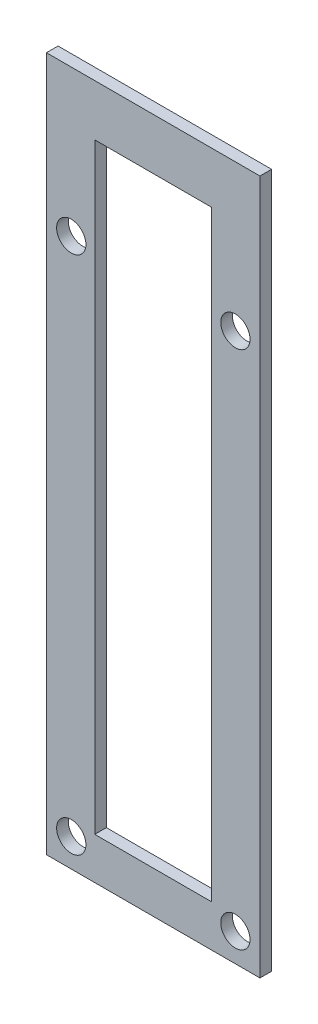
ISO-10303-21;
HEADER;
FILE_DESCRIPTION(('STEP AP214'),'2;1');
FILE_NAME('part.step','',(''),(''),'','','');
FILE_SCHEMA(('AUTOMOTIVE_DESIGN { 1 0 10303 214 1 1 1 1 }'));
ENDSEC;
DATA;
#1=APPLICATION_CONTEXT('core data for automotive mechanical design processes');
#2=APPLICATION_PROTOCOL_DEFINITION('international standard','automotive_design',2000,#1);
#3=PRODUCT_CONTEXT('',#1,'mechanical');
#4=PRODUCT('Part','Part','',(#3));
#5=PRODUCT_RELATED_PRODUCT_CATEGORY('part','',(#4));
#6=PRODUCT_DEFINITION_FORMATION('','',#4);
#7=PRODUCT_DEFINITION_CONTEXT('part definition',#1,'design');
#8=PRODUCT_DEFINITION('design','',#6,#7);
#9=PRODUCT_DEFINITION_SHAPE('','',#8);
#10=(LENGTH_UNIT() NAMED_UNIT(*) SI_UNIT(.MILLI.,.METRE.));
#11=(NAMED_UNIT(*) PLANE_ANGLE_UNIT() SI_UNIT($,.RADIAN.));
#12=(NAMED_UNIT(*) SI_UNIT($,.STERADIAN.) SOLID_ANGLE_UNIT());
#13=UNCERTAINTY_MEASURE_WITH_UNIT(LENGTH_MEASURE(1.E-05),#10,'distance_accuracy_value','');
#14=(GEOMETRIC_REPRESENTATION_CONTEXT(3) GLOBAL_UNCERTAINTY_ASSIGNED_CONTEXT((#13)) GLOBAL_UNIT_ASSIGNED_CONTEXT((#10,
#11,#12)) REPRESENTATION_CONTEXT('',''));
#15=CARTESIAN_POINT('',(0.,0.,0.));
#16=DIRECTION('',(0.,0.,1.));
#17=DIRECTION('',(1.,0.,0.));
#18=AXIS2_PLACEMENT_3D('',#15,#16,#17);
#19=CARTESIAN_POINT('',(-6.6,94.86,1.5875));
#20=DIRECTION('',(1.,0.,0.));
#21=DIRECTION('',(0.,1.,0.));
#22=AXIS2_PLACEMENT_3D('',#19,#20,#21);
#23=PLANE('',#22);
#24=DIRECTION('',(0.,0.,-1.));
#25=VECTOR('',#24,1.);
#26=CARTESIAN_POINT('',(-6.59999999999172,87.8560754392765,1.5875));
#27=LINE('',#26,#25);
#28=CARTESIAN_POINT('',(-6.6,87.8560754392765,1.5875));
#29=VERTEX_POINT('',#28);
#30=CARTESIAN_POINT('',(-6.59999999999172,87.8560754392765,0.));
#31=VERTEX_POINT('',#30);
#32=EDGE_CURVE('E112',#29,#31,#27,.T.);
#33=ORIENTED_EDGE('',*,*,#32,.T.);
#34=DIRECTION('',(0.,-1.,0.));
#35=VECTOR('',#34,1.);
#36=CARTESIAN_POINT('',(-6.6,94.86,0.));
#37=LINE('',#36,#35);
#38=CARTESIAN_POINT('',(-6.59999999999999,5.70999999999999,0.));
#39=VERTEX_POINT('',#38);
#40=EDGE_CURVE('E102',#31,#39,#37,.T.);
#41=ORIENTED_EDGE('',*,*,#40,.T.);
#42=DIRECTION('',(0.,0.,-1.));
#43=VECTOR('',#42,1.);
#44=CARTESIAN_POINT('',(-6.59999999999999,5.70999999999999,1.5875));
#45=LINE('',#44,#43);
#46=CARTESIAN_POINT('',(-6.59999999999999,5.70999999999999,1.5875));
#47=VERTEX_POINT('',#46);
#48=EDGE_CURVE('E159',#47,#39,#45,.T.);
#49=ORIENTED_EDGE('',*,*,#48,.F.);
#50=DIRECTION('',(0.,-1.,0.));
#51=VECTOR('',#50,1.);
#52=CARTESIAN_POINT('',(-6.6,94.86,1.5875));
#53=LINE('',#52,#51);
#54=EDGE_CURVE('E58',#29,#47,#53,.T.);
#55=ORIENTED_EDGE('',*,*,#54,.F.);
#56=EDGE_LOOP('',(#33,#41,#49,#55));
#57=FACE_BOUND('',#56,.T.);
#58=ADVANCED_FACE('F33',(#57),#23,.F.);
#59=CARTESIAN_POINT('',(-22.56,5.70999999999999,1.5875));
#60=DIRECTION('',(-1.,0.,0.));
#61=DIRECTION('',(0.,0.,1.));
#62=AXIS2_PLACEMENT_3D('',#59,#60,#61);
#63=PLANE('',#62);
#64=DIRECTION('',(0.,0.,-1.));
#65=VECTOR('',#64,1.);
#66=CARTESIAN_POINT('',(-22.56,87.8560754392765,1.5875));
#67=LINE('',#66,#65);
#68=CARTESIAN_POINT('',(-22.56,87.8560754392765,1.5875));
#69=VERTEX_POINT('',#68);
#70=CARTESIAN_POINT('',(-22.56,87.8560754392765,0.));
#71=VERTEX_POINT('',#70);
#72=EDGE_CURVE('E50',#69,#71,#67,.T.);
#73=ORIENTED_EDGE('',*,*,#72,.F.);
#74=DIRECTION('',(0.,1.,0.));
#75=VECTOR('',#74,1.);
#76=CARTESIAN_POINT('',(-22.56,5.70999999999999,1.5875));
#77=LINE('',#76,#75);
#78=CARTESIAN_POINT('',(-22.56,5.70999999999999,1.5875));
#79=VERTEX_POINT('',#78);
#80=EDGE_CURVE('E136',#79,#69,#77,.T.);
#81=ORIENTED_EDGE('',*,*,#80,.F.);
#82=DIRECTION('',(0.,0.,-1.));
#83=VECTOR('',#82,1.);
#84=CARTESIAN_POINT('',(-22.56,5.70999999999999,1.5875));
#85=LINE('',#84,#83);
#86=CARTESIAN_POINT('',(-22.56,5.70999999999999,0.));
#87=VERTEX_POINT('',#86);
#88=EDGE_CURVE('E156',#79,#87,#85,.T.);
#89=ORIENTED_EDGE('',*,*,#88,.T.);
#90=DIRECTION('',(0.,1.,0.));
#91=VECTOR('',#90,1.);
#92=CARTESIAN_POINT('',(-22.56,5.70999999999999,0.));
#93=LINE('',#92,#91);
#94=EDGE_CURVE('E146',#87,#71,#93,.T.);
#95=ORIENTED_EDGE('',*,*,#94,.T.);
#96=EDGE_LOOP('',(#73,#81,#89,#95));
#97=FACE_BOUND('',#96,.T.);
#98=ADVANCED_FACE('F221',(#97),#63,.F.);
#99=CARTESIAN_POINT('',(-29.16,0.,1.5875));
#100=DIRECTION('',(0.,1.,0.));
#101=DIRECTION('',(0.,0.,1.));
#102=AXIS2_PLACEMENT_3D('',#99,#100,#101);
#103=PLANE('',#102);
#104=DIRECTION('',(1.,0.,0.));
#105=VECTOR('',#104,1.);
#106=CARTESIAN_POINT('',(-29.16,0.,0.));
#107=LINE('',#106,#105);
#108=CARTESIAN_POINT('',(-29.16,0.,0.));
#109=VERTEX_POINT('',#108);
#110=CARTESIAN_POINT('',(0.,0.,0.));
#111=VERTEX_POINT('',#110);
#112=EDGE_CURVE('E121',#109,#111,#107,.T.);
#113=ORIENTED_EDGE('',*,*,#112,.T.);
#114=DIRECTION('',(0.,0.,-1.));
#115=VECTOR('',#114,1.);
#116=CARTESIAN_POINT('',(0.,0.,1.5875));
#117=LINE('',#116,#115);
#118=CARTESIAN_POINT('',(0.,0.,1.5875));
#119=VERTEX_POINT('',#118);
#120=EDGE_CURVE('E11',#119,#111,#117,.T.);
#121=ORIENTED_EDGE('',*,*,#120,.F.);
#122=DIRECTION('',(1.,0.,0.));
#123=VECTOR('',#122,1.);
#124=CARTESIAN_POINT('',(-29.16,0.,1.5875));
#125=LINE('',#124,#123);
#126=CARTESIAN_POINT('',(-29.16,0.,1.5875));
#127=VERTEX_POINT('',#126);
#128=EDGE_CURVE('E125',#127,#119,#125,.T.);
#129=ORIENTED_EDGE('',*,*,#128,.F.);
#130=DIRECTION('',(0.,0.,-1.));
#131=VECTOR('',#130,1.);
#132=CARTESIAN_POINT('',(-29.16,0.,1.5875));
#133=LINE('',#132,#131);
#134=EDGE_CURVE('E140',#127,#109,#133,.T.);
#135=ORIENTED_EDGE('',*,*,#134,.T.);
#136=EDGE_LOOP('',(#113,#121,#129,#135));
#137=FACE_BOUND('',#136,.T.);
#138=ADVANCED_FACE('F35',(#137),#103,.F.);
#139=CARTESIAN_POINT('',(0.,0.,1.5875));
#140=DIRECTION('',(-1.,0.,0.));
#141=DIRECTION('',(0.,0.,1.));
#142=AXIS2_PLACEMENT_3D('',#139,#140,#141);
#143=PLANE('',#142);
#144=DIRECTION('',(0.,1.,0.));
#145=VECTOR('',#144,1.);
#146=CARTESIAN_POINT('',(0.,0.,0.));
#147=LINE('',#146,#145);
#148=CARTESIAN_POINT('',(0.,94.86,0.));
#149=VERTEX_POINT('',#148);
#150=EDGE_CURVE('E110',#111,#149,#147,.T.);
#151=ORIENTED_EDGE('',*,*,#150,.T.);
#152=DIRECTION('',(0.,0.,-1.));
#153=VECTOR('',#152,1.);
#154=CARTESIAN_POINT('',(0.,94.86,1.5875));
#155=LINE('',#154,#153);
#156=CARTESIAN_POINT('',(0.,94.86,1.5875));
#157=VERTEX_POINT('',#156);
#158=EDGE_CURVE('E42',#157,#149,#155,.T.);
#159=ORIENTED_EDGE('',*,*,#158,.F.);
#160=DIRECTION('',(0.,1.,0.));
#161=VECTOR('',#160,1.);
#162=CARTESIAN_POINT('',(0.,0.,1.5875));
#163=LINE('',#162,#161);
#164=EDGE_CURVE('E128',#119,#157,#163,.T.);
#165=ORIENTED_EDGE('',*,*,#164,.F.);
#166=ORIENTED_EDGE('',*,*,#120,.T.);
#167=EDGE_LOOP('',(#151,#159,#165,#166));
#168=FACE_BOUND('',#167,.T.);
#169=ADVANCED_FACE('F205',(#168),#143,.F.);
#170=CARTESIAN_POINT('',(-6.59999999999999,5.70999999999999,1.5875));
#171=DIRECTION('',(0.,-1.,0.));
#172=DIRECTION('',(1.,0.,0.));
#173=AXIS2_PLACEMENT_3D('',#170,#171,#172);
#174=PLANE('',#173);
#175=DIRECTION('',(-1.,0.,0.));
#176=VECTOR('',#175,1.);
#177=CARTESIAN_POINT('',(-6.59999999999999,5.70999999999999,0.));
#178=LINE('',#177,#176);
#179=EDGE_CURVE('E108',#39,#87,#178,.T.);
#180=ORIENTED_EDGE('',*,*,#179,.T.);
#181=ORIENTED_EDGE('',*,*,#88,.F.);
#182=DIRECTION('',(-1.,0.,0.));
#183=VECTOR('',#182,1.);
#184=CARTESIAN_POINT('',(-6.59999999999999,5.70999999999999,1.5875));
#185=LINE('',#184,#183);
#186=EDGE_CURVE('E134',#47,#79,#185,.T.);
#187=ORIENTED_EDGE('',*,*,#186,.F.);
#188=ORIENTED_EDGE('',*,*,#48,.T.);
#189=EDGE_LOOP('',(#180,#181,#187,#188));
#190=FACE_BOUND('',#189,.T.);
#191=ADVANCED_FACE('F228',(#190),#174,.F.);
#192=CARTESIAN_POINT('',(-22.56,94.86,1.5875));
#193=DIRECTION('',(0.,-1.,0.));
#194=DIRECTION('',(0.,0.,-1.));
#195=AXIS2_PLACEMENT_3D('',#192,#193,#194);
#196=PLANE('',#195);
#197=DIRECTION('',(-1.,0.,0.));
#198=VECTOR('',#197,1.);
#199=CARTESIAN_POINT('',(-22.56,94.86,0.));
#200=LINE('',#199,#198);
#201=CARTESIAN_POINT('',(-29.16,94.86,0.));
#202=VERTEX_POINT('',#201);
#203=EDGE_CURVE('E148',#149,#202,#200,.T.);
#204=ORIENTED_EDGE('',*,*,#203,.T.);
#205=DIRECTION('',(0.,0.,-1.));
#206=VECTOR('',#205,1.);
#207=CARTESIAN_POINT('',(-29.16,94.86,1.5875));
#208=LINE('',#207,#206);
#209=CARTESIAN_POINT('',(-29.16,94.86,1.5875));
#210=VERTEX_POINT('',#209);
#211=EDGE_CURVE('E153',#210,#202,#208,.T.);
#212=ORIENTED_EDGE('',*,*,#211,.F.);
#213=DIRECTION('',(-1.,0.,0.));
#214=VECTOR('',#213,1.);
#215=CARTESIAN_POINT('',(0.,94.86,1.5875));
#216=LINE('',#215,#214);
#217=EDGE_CURVE('E131',#157,#210,#216,.T.);
#218=ORIENTED_EDGE('',*,*,#217,.F.);
#219=ORIENTED_EDGE('',*,*,#158,.T.);
#220=EDGE_LOOP('',(#204,#212,#218,#219));
#221=FACE_BOUND('',#220,.T.);
#222=ADVANCED_FACE('F209',(#221),#196,.F.);
#223=CARTESIAN_POINT('',(-29.16,94.86,1.5875));
#224=DIRECTION('',(1.,0.,0.));
#225=DIRECTION('',(0.,0.,-1.));
#226=AXIS2_PLACEMENT_3D('',#223,#224,#225);
#227=PLANE('',#226);
#228=DIRECTION('',(0.,-1.,0.));
#229=VECTOR('',#228,1.);
#230=CARTESIAN_POINT('',(-29.16,94.86,0.));
#231=LINE('',#230,#229);
#232=EDGE_CURVE('E129',#202,#109,#231,.T.);
#233=ORIENTED_EDGE('',*,*,#232,.T.);
#234=ORIENTED_EDGE('',*,*,#134,.F.);
#235=DIRECTION('',(0.,-1.,0.));
#236=VECTOR('',#235,1.);
#237=CARTESIAN_POINT('',(-29.16,94.86,1.5875));
#238=LINE('',#237,#236);
#239=EDGE_CURVE('E138',#210,#127,#238,.T.);
#240=ORIENTED_EDGE('',*,*,#239,.F.);
#241=ORIENTED_EDGE('',*,*,#211,.T.);
#242=EDGE_LOOP('',(#233,#234,#240,#241));
#243=FACE_BOUND('',#242,.T.);
#244=ADVANCED_FACE('F193',(#243),#227,.F.);
#245=CARTESIAN_POINT('',(0.,0.,1.5875));
#246=DIRECTION('',(0.,0.,1.));
#247=DIRECTION('',(1.,0.,0.));
#248=AXIS2_PLACEMENT_3D('',#245,#246,#247);
#249=PLANE('',#248);
#250=CARTESIAN_POINT('',(-3.35435339282858,74.86,1.5875));
#251=DIRECTION('',(0.,0.,1.));
#252=DIRECTION('',(1.,0.,0.));
#253=AXIS2_PLACEMENT_3D('',#250,#251,#252);
#254=CIRCLE('',#253,2.);
#255=CARTESIAN_POINT('',(-1.35435339282858,74.86,1.5875));
#256=VERTEX_POINT('',#255);
#257=EDGE_CURVE('E181',#256,#256,#254,.T.);
#258=ORIENTED_EDGE('',*,*,#257,.F.);
#259=EDGE_LOOP('',(#258));
#260=FACE_BOUND('',#259,.T.);
#261=CARTESIAN_POINT('',(-25.7710243855859,74.86,1.5875));
#262=DIRECTION('',(0.,0.,1.));
#263=DIRECTION('',(1.,0.,0.));
#264=AXIS2_PLACEMENT_3D('',#261,#262,#263);
#265=CIRCLE('',#264,2.);
#266=CARTESIAN_POINT('',(-23.7710243855859,74.86,1.5875));
#267=VERTEX_POINT('',#266);
#268=EDGE_CURVE('E171',#267,#267,#265,.T.);
#269=ORIENTED_EDGE('',*,*,#268,.F.);
#270=EDGE_LOOP('',(#269));
#271=FACE_BOUND('',#270,.T.);
#272=CARTESIAN_POINT('',(-3.35435339282858,3.86,1.5875));
#273=DIRECTION('',(0.,0.,1.));
#274=DIRECTION('',(1.,0.,0.));
#275=AXIS2_PLACEMENT_3D('',#272,#273,#274);
#276=CIRCLE('',#275,2.);
#277=CARTESIAN_POINT('',(-1.35435339282858,3.86,1.5875));
#278=VERTEX_POINT('',#277);
#279=EDGE_CURVE('E168',#278,#278,#276,.T.);
#280=ORIENTED_EDGE('',*,*,#279,.F.);
#281=EDGE_LOOP('',(#280));
#282=FACE_BOUND('',#281,.T.);
#283=CARTESIAN_POINT('',(-25.7710243855859,3.86,1.5875));
#284=DIRECTION('',(0.,0.,1.));
#285=DIRECTION('',(1.,0.,0.));
#286=AXIS2_PLACEMENT_3D('',#283,#284,#285);
#287=CIRCLE('',#286,2.);
#288=CARTESIAN_POINT('',(-23.7710243855859,3.86,1.5875));
#289=VERTEX_POINT('',#288);
#290=EDGE_CURVE('E165',#289,#289,#287,.T.);
#291=ORIENTED_EDGE('',*,*,#290,.F.);
#292=EDGE_LOOP('',(#291));
#293=FACE_BOUND('',#292,.T.);
#294=DIRECTION('',(-1.,0.,0.));
#295=VECTOR('',#294,1.);
#296=CARTESIAN_POINT('',(500000.,87.8560754392765,1.5875));
#297=LINE('',#296,#295);
#298=EDGE_CURVE('E116',#29,#69,#297,.T.);
#299=ORIENTED_EDGE('',*,*,#298,.F.);
#300=ORIENTED_EDGE('',*,*,#54,.T.);
#301=ORIENTED_EDGE('',*,*,#186,.T.);
#302=ORIENTED_EDGE('',*,*,#80,.T.);
#303=EDGE_LOOP('',(#299,#300,#301,#302));
#304=FACE_BOUND('',#303,.T.);
#305=ORIENTED_EDGE('',*,*,#128,.T.);
#306=ORIENTED_EDGE('',*,*,#164,.T.);
#307=ORIENTED_EDGE('',*,*,#217,.T.);
#308=ORIENTED_EDGE('',*,*,#239,.T.);
#309=EDGE_LOOP('',(#305,#306,#307,#308));
#310=FACE_BOUND('',#309,.T.);
#311=ADVANCED_FACE('F190',(#260,#271,#282,#293,#304,#310),#249,.T.);
#312=CARTESIAN_POINT('',(0.,0.,0.));
#313=DIRECTION('',(0.,0.,1.));
#314=DIRECTION('',(1.,0.,0.));
#315=AXIS2_PLACEMENT_3D('',#312,#313,#314);
#316=PLANE('',#315);
#317=CARTESIAN_POINT('',(-3.35435339282858,74.86,0.));
#318=DIRECTION('',(0.,0.,1.));
#319=DIRECTION('',(1.,0.,0.));
#320=AXIS2_PLACEMENT_3D('',#317,#318,#319);
#321=CIRCLE('',#320,2.);
#322=CARTESIAN_POINT('',(-1.35435339282858,74.86,0.));
#323=VERTEX_POINT('',#322);
#324=EDGE_CURVE('E37',#323,#323,#321,.T.);
#325=ORIENTED_EDGE('',*,*,#324,.T.);
#326=EDGE_LOOP('',(#325));
#327=FACE_BOUND('',#326,.T.);
#328=CARTESIAN_POINT('',(-25.7710243855859,74.86,0.));
#329=DIRECTION('',(0.,0.,1.));
#330=DIRECTION('',(1.,0.,0.));
#331=AXIS2_PLACEMENT_3D('',#328,#329,#330);
#332=CIRCLE('',#331,2.);
#333=CARTESIAN_POINT('',(-23.7710243855859,74.86,0.));
#334=VERTEX_POINT('',#333);
#335=EDGE_CURVE('E169',#334,#334,#332,.T.);
#336=ORIENTED_EDGE('',*,*,#335,.T.);
#337=EDGE_LOOP('',(#336));
#338=FACE_BOUND('',#337,.T.);
#339=CARTESIAN_POINT('',(-3.35435339282858,3.86,0.));
#340=DIRECTION('',(0.,0.,1.));
#341=DIRECTION('',(1.,0.,0.));
#342=AXIS2_PLACEMENT_3D('',#339,#340,#341);
#343=CIRCLE('',#342,2.);
#344=CARTESIAN_POINT('',(-1.35435339282858,3.86,0.));
#345=VERTEX_POINT('',#344);
#346=EDGE_CURVE('E166',#345,#345,#343,.T.);
#347=ORIENTED_EDGE('',*,*,#346,.T.);
#348=EDGE_LOOP('',(#347));
#349=FACE_BOUND('',#348,.T.);
#350=CARTESIAN_POINT('',(-25.7710243855859,3.86,0.));
#351=DIRECTION('',(0.,0.,1.));
#352=DIRECTION('',(1.,0.,0.));
#353=AXIS2_PLACEMENT_3D('',#350,#351,#352);
#354=CIRCLE('',#353,2.);
#355=CARTESIAN_POINT('',(-23.7710243855859,3.86,0.));
#356=VERTEX_POINT('',#355);
#357=EDGE_CURVE('E117',#356,#356,#354,.T.);
#358=ORIENTED_EDGE('',*,*,#357,.T.);
#359=EDGE_LOOP('',(#358));
#360=FACE_BOUND('',#359,.T.);
#361=ORIENTED_EDGE('',*,*,#40,.F.);
#362=DIRECTION('',(-1.,0.,0.));
#363=VECTOR('',#362,1.);
#364=CARTESIAN_POINT('',(500000.,87.8560754392765,0.));
#365=LINE('',#364,#363);
#366=EDGE_CURVE('E107',#31,#71,#365,.T.);
#367=ORIENTED_EDGE('',*,*,#366,.T.);
#368=ORIENTED_EDGE('',*,*,#94,.F.);
#369=ORIENTED_EDGE('',*,*,#179,.F.);
#370=EDGE_LOOP('',(#361,#367,#368,#369));
#371=FACE_BOUND('',#370,.T.);
#372=ORIENTED_EDGE('',*,*,#112,.F.);
#373=ORIENTED_EDGE('',*,*,#232,.F.);
#374=ORIENTED_EDGE('',*,*,#203,.F.);
#375=ORIENTED_EDGE('',*,*,#150,.F.);
#376=EDGE_LOOP('',(#372,#373,#374,#375));
#377=FACE_BOUND('',#376,.T.);
#378=ADVANCED_FACE('F103',(#327,#338,#349,#360,#371,#377),#316,.F.);
#379=CARTESIAN_POINT('',(500000.,87.8560754392765,1.5875));
#380=DIRECTION('',(0.,1.,0.));
#381=DIRECTION('',(0.,0.,1.));
#382=AXIS2_PLACEMENT_3D('',#379,#380,#381);
#383=PLANE('',#382);
#384=ORIENTED_EDGE('',*,*,#32,.F.);
#385=ORIENTED_EDGE('',*,*,#298,.T.);
#386=ORIENTED_EDGE('',*,*,#72,.T.);
#387=ORIENTED_EDGE('',*,*,#366,.F.);
#388=EDGE_LOOP('',(#384,#385,#386,#387));
#389=FACE_BOUND('',#388,.T.);
#390=ADVANCED_FACE('F119',(#389),#383,.F.);
#391=CARTESIAN_POINT('',(-25.7710243855859,3.86,-13.4125));
#392=DIRECTION('',(0.,0.,1.));
#393=DIRECTION('',(1.,0.,0.));
#394=AXIS2_PLACEMENT_3D('',#391,#392,#393);
#395=CYLINDRICAL_SURFACE('',#394,2.);
#396=ORIENTED_EDGE('',*,*,#290,.T.);
#397=EDGE_LOOP('',(#396));
#398=FACE_BOUND('',#397,.T.);
#399=ORIENTED_EDGE('',*,*,#357,.F.);
#400=EDGE_LOOP('',(#399));
#401=FACE_BOUND('',#400,.T.);
#402=ADVANCED_FACE('F187',(#398,#401),#395,.F.);
#403=CARTESIAN_POINT('',(-3.35435339282858,3.86,-13.4125));
#404=DIRECTION('',(0.,0.,1.));
#405=DIRECTION('',(1.,0.,0.));
#406=AXIS2_PLACEMENT_3D('',#403,#404,#405);
#407=CYLINDRICAL_SURFACE('',#406,2.);
#408=ORIENTED_EDGE('',*,*,#279,.T.);
#409=EDGE_LOOP('',(#408));
#410=FACE_BOUND('',#409,.T.);
#411=ORIENTED_EDGE('',*,*,#346,.F.);
#412=EDGE_LOOP('',(#411));
#413=FACE_BOUND('',#412,.T.);
#414=ADVANCED_FACE('F272',(#410,#413),#407,.F.);
#415=CARTESIAN_POINT('',(-25.7710243855859,74.86,-13.4125));
#416=DIRECTION('',(0.,0.,1.));
#417=DIRECTION('',(1.,0.,0.));
#418=AXIS2_PLACEMENT_3D('',#415,#416,#417);
#419=CYLINDRICAL_SURFACE('',#418,2.);
#420=ORIENTED_EDGE('',*,*,#268,.T.);
#421=EDGE_LOOP('',(#420));
#422=FACE_BOUND('',#421,.T.);
#423=ORIENTED_EDGE('',*,*,#335,.F.);
#424=EDGE_LOOP('',(#423));
#425=FACE_BOUND('',#424,.T.);
#426=ADVANCED_FACE('F281',(#422,#425),#419,.F.);
#427=CARTESIAN_POINT('',(-3.35435339282858,74.86,-13.4125));
#428=DIRECTION('',(0.,0.,1.));
#429=DIRECTION('',(1.,0.,0.));
#430=AXIS2_PLACEMENT_3D('',#427,#428,#429);
#431=CYLINDRICAL_SURFACE('',#430,2.);
#432=ORIENTED_EDGE('',*,*,#257,.T.);
#433=EDGE_LOOP('',(#432));
#434=FACE_BOUND('',#433,.T.);
#435=ORIENTED_EDGE('',*,*,#324,.F.);
#436=EDGE_LOOP('',(#435));
#437=FACE_BOUND('',#436,.T.);
#438=ADVANCED_FACE('F291',(#434,#437),#431,.F.);
#439=CLOSED_SHELL('',(#58,#98,#138,#169,#191,#222,#244,#311,#378,#390,#402,#414,#426,#438));
#440=MANIFOLD_SOLID_BREP('B2',#439);
#441=ADVANCED_BREP_SHAPE_REPRESENTATION('',(#18,#440),#14);
#442=SHAPE_DEFINITION_REPRESENTATION(#9,#441);
ENDSEC;
END-ISO-10303-21;
